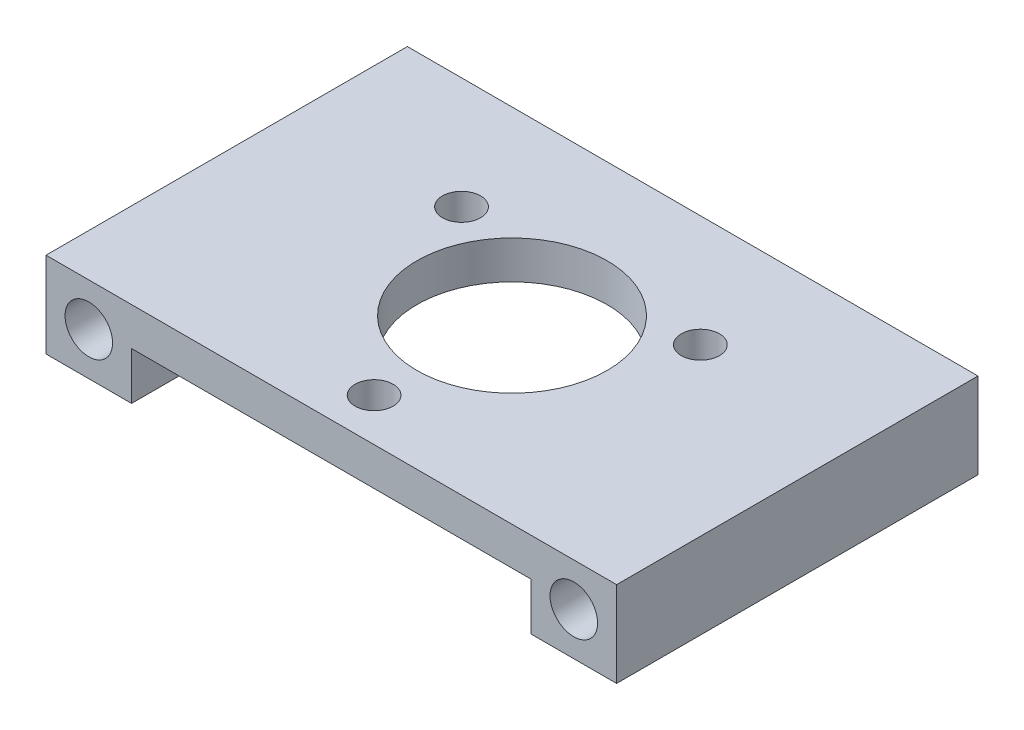
ISO-10303-21;
HEADER;
FILE_DESCRIPTION(('STEP AP214'),'2;1');
FILE_NAME('part.step','',(''),(''),'','','');
FILE_SCHEMA(('AUTOMOTIVE_DESIGN { 1 0 10303 214 1 1 1 1 }'));
ENDSEC;
DATA;
#1=APPLICATION_CONTEXT('core data for automotive mechanical design processes');
#2=APPLICATION_PROTOCOL_DEFINITION('international standard','automotive_design',2000,#1);
#3=PRODUCT_CONTEXT('',#1,'mechanical');
#4=PRODUCT('Part','Part','',(#3));
#5=PRODUCT_RELATED_PRODUCT_CATEGORY('part','',(#4));
#6=PRODUCT_DEFINITION_FORMATION('','',#4);
#7=PRODUCT_DEFINITION_CONTEXT('part definition',#1,'design');
#8=PRODUCT_DEFINITION('design','',#6,#7);
#9=PRODUCT_DEFINITION_SHAPE('','',#8);
#10=(LENGTH_UNIT() NAMED_UNIT(*) SI_UNIT(.MILLI.,.METRE.));
#11=(NAMED_UNIT(*) PLANE_ANGLE_UNIT() SI_UNIT($,.RADIAN.));
#12=(NAMED_UNIT(*) SI_UNIT($,.STERADIAN.) SOLID_ANGLE_UNIT());
#13=UNCERTAINTY_MEASURE_WITH_UNIT(LENGTH_MEASURE(1.E-05),#10,'distance_accuracy_value','');
#14=(GEOMETRIC_REPRESENTATION_CONTEXT(3) GLOBAL_UNCERTAINTY_ASSIGNED_CONTEXT((#13)) GLOBAL_UNIT_ASSIGNED_CONTEXT((#10,
#11,#12)) REPRESENTATION_CONTEXT('',''));
#15=CARTESIAN_POINT('',(0.,0.,0.));
#16=DIRECTION('',(0.,0.,1.));
#17=DIRECTION('',(1.,0.,0.));
#18=AXIS2_PLACEMENT_3D('',#15,#16,#17);
#19=CARTESIAN_POINT('',(0.,0.,38.));
#20=DIRECTION('',(0.,0.,-1.));
#21=DIRECTION('',(-1.,0.,0.));
#22=AXIS2_PLACEMENT_3D('',#19,#20,#21);
#23=PLANE('',#22);
#24=DIRECTION('',(-1.,0.,0.));
#25=VECTOR('',#24,1.);
#26=CARTESIAN_POINT('',(-30.,0.,38.));
#27=LINE('',#26,#25);
#28=CARTESIAN_POINT('',(30.,0.,38.));
#29=VERTEX_POINT('',#28);
#30=CARTESIAN_POINT('',(-30.,0.,38.));
#31=VERTEX_POINT('',#30);
#32=EDGE_CURVE('E146',#29,#31,#27,.T.);
#33=ORIENTED_EDGE('',*,*,#32,.T.);
#34=DIRECTION('',(0.,-1.,0.));
#35=VECTOR('',#34,1.);
#36=CARTESIAN_POINT('',(-30.,0.,38.));
#37=LINE('',#36,#35);
#38=CARTESIAN_POINT('',(-30.,-9.00000000000001,38.));
#39=VERTEX_POINT('',#38);
#40=EDGE_CURVE('E94',#31,#39,#37,.T.);
#41=ORIENTED_EDGE('',*,*,#40,.T.);
#42=DIRECTION('',(1.,0.,0.));
#43=VECTOR('',#42,1.);
#44=CARTESIAN_POINT('',(-30.,-9.00000000000001,38.));
#45=LINE('',#44,#43);
#46=CARTESIAN_POINT('',(-21.,-9.00000000000001,38.));
#47=VERTEX_POINT('',#46);
#48=EDGE_CURVE('E161',#39,#47,#45,.T.);
#49=ORIENTED_EDGE('',*,*,#48,.T.);
#50=DIRECTION('',(0.,1.,0.));
#51=VECTOR('',#50,1.);
#52=CARTESIAN_POINT('',(-21.,-9.00000000000001,38.));
#53=LINE('',#52,#51);
#54=CARTESIAN_POINT('',(-21.,-4.,38.));
#55=VERTEX_POINT('',#54);
#56=EDGE_CURVE('E174',#47,#55,#53,.T.);
#57=ORIENTED_EDGE('',*,*,#56,.T.);
#58=DIRECTION('',(1.,0.,0.));
#59=VECTOR('',#58,1.);
#60=CARTESIAN_POINT('',(-21.,-4.,38.));
#61=LINE('',#60,#59);
#62=CARTESIAN_POINT('',(21.,-4.,38.));
#63=VERTEX_POINT('',#62);
#64=EDGE_CURVE('E113',#55,#63,#61,.T.);
#65=ORIENTED_EDGE('',*,*,#64,.T.);
#66=DIRECTION('',(0.,-1.,0.));
#67=VECTOR('',#66,1.);
#68=CARTESIAN_POINT('',(21.,-9.,38.));
#69=LINE('',#68,#67);
#70=CARTESIAN_POINT('',(21.,-9.,38.));
#71=VERTEX_POINT('',#70);
#72=EDGE_CURVE('E107',#63,#71,#69,.T.);
#73=ORIENTED_EDGE('',*,*,#72,.T.);
#74=DIRECTION('',(1.,0.,0.));
#75=VECTOR('',#74,1.);
#76=CARTESIAN_POINT('',(30.,-9.,38.));
#77=LINE('',#76,#75);
#78=CARTESIAN_POINT('',(30.,-9.,38.));
#79=VERTEX_POINT('',#78);
#80=EDGE_CURVE('E111',#71,#79,#77,.T.);
#81=ORIENTED_EDGE('',*,*,#80,.T.);
#82=DIRECTION('',(0.,1.,0.));
#83=VECTOR('',#82,1.);
#84=CARTESIAN_POINT('',(30.,0.,38.));
#85=LINE('',#84,#83);
#86=EDGE_CURVE('E51',#79,#29,#85,.T.);
#87=ORIENTED_EDGE('',*,*,#86,.T.);
#88=EDGE_LOOP('',(#33,#41,#49,#57,#65,#73,#81,#87));
#89=FACE_BOUND('',#88,.T.);
#90=CARTESIAN_POINT('',(25.5,-4.5,38.));
#91=DIRECTION('',(0.,0.,1.));
#92=DIRECTION('',(-1.,0.,0.));
#93=AXIS2_PLACEMENT_3D('',#90,#91,#92);
#94=CIRCLE('',#93,2.5);
#95=CARTESIAN_POINT('',(23.,-4.5,38.));
#96=VERTEX_POINT('',#95);
#97=EDGE_CURVE('E135',#96,#96,#94,.T.);
#98=ORIENTED_EDGE('',*,*,#97,.F.);
#99=EDGE_LOOP('',(#98));
#100=FACE_BOUND('',#99,.T.);
#101=CARTESIAN_POINT('',(-25.5,-4.5,38.));
#102=DIRECTION('',(0.,0.,1.));
#103=DIRECTION('',(1.,0.,0.));
#104=AXIS2_PLACEMENT_3D('',#101,#102,#103);
#105=CIRCLE('',#104,2.5);
#106=CARTESIAN_POINT('',(-23.,-4.5,38.));
#107=VERTEX_POINT('',#106);
#108=EDGE_CURVE('E183',#107,#107,#105,.T.);
#109=ORIENTED_EDGE('',*,*,#108,.F.);
#110=EDGE_LOOP('',(#109));
#111=FACE_BOUND('',#110,.T.);
#112=ADVANCED_FACE('F34',(#89,#100,#111),#23,.F.);
#113=CARTESIAN_POINT('',(0.,0.,0.));
#114=DIRECTION('',(0.,0.,-1.));
#115=DIRECTION('',(-1.,0.,0.));
#116=AXIS2_PLACEMENT_3D('',#113,#114,#115);
#117=PLANE('',#116);
#118=CARTESIAN_POINT('',(25.5,-4.5,0.));
#119=DIRECTION('',(0.,0.,1.));
#120=DIRECTION('',(-1.,0.,0.));
#121=AXIS2_PLACEMENT_3D('',#118,#119,#120);
#122=CIRCLE('',#121,2.5);
#123=CARTESIAN_POINT('',(23.,-4.5,0.));
#124=VERTEX_POINT('',#123);
#125=EDGE_CURVE('E180',#124,#124,#122,.T.);
#126=ORIENTED_EDGE('',*,*,#125,.T.);
#127=EDGE_LOOP('',(#126));
#128=FACE_BOUND('',#127,.T.);
#129=DIRECTION('',(-1.,0.,0.));
#130=VECTOR('',#129,1.);
#131=CARTESIAN_POINT('',(-30.,0.,0.));
#132=LINE('',#131,#130);
#133=CARTESIAN_POINT('',(30.,0.,0.));
#134=VERTEX_POINT('',#133);
#135=CARTESIAN_POINT('',(-30.,0.,0.));
#136=VERTEX_POINT('',#135);
#137=EDGE_CURVE('E131',#134,#136,#132,.T.);
#138=ORIENTED_EDGE('',*,*,#137,.F.);
#139=DIRECTION('',(0.,1.,0.));
#140=VECTOR('',#139,1.);
#141=CARTESIAN_POINT('',(30.,0.,0.));
#142=LINE('',#141,#140);
#143=CARTESIAN_POINT('',(30.,-9.,0.));
#144=VERTEX_POINT('',#143);
#145=EDGE_CURVE('E86',#144,#134,#142,.T.);
#146=ORIENTED_EDGE('',*,*,#145,.F.);
#147=DIRECTION('',(1.,0.,0.));
#148=VECTOR('',#147,1.);
#149=CARTESIAN_POINT('',(30.,-9.,0.));
#150=LINE('',#149,#148);
#151=CARTESIAN_POINT('',(21.,-9.,0.));
#152=VERTEX_POINT('',#151);
#153=EDGE_CURVE('E80',#152,#144,#150,.T.);
#154=ORIENTED_EDGE('',*,*,#153,.F.);
#155=DIRECTION('',(0.,-1.,0.));
#156=VECTOR('',#155,1.);
#157=CARTESIAN_POINT('',(21.,-9.,0.));
#158=LINE('',#157,#156);
#159=CARTESIAN_POINT('',(21.,-4.,0.));
#160=VERTEX_POINT('',#159);
#161=EDGE_CURVE('E121',#160,#152,#158,.T.);
#162=ORIENTED_EDGE('',*,*,#161,.F.);
#163=DIRECTION('',(1.,0.,0.));
#164=VECTOR('',#163,1.);
#165=CARTESIAN_POINT('',(-21.,-4.,0.));
#166=LINE('',#165,#164);
#167=CARTESIAN_POINT('',(-21.,-4.,0.));
#168=VERTEX_POINT('',#167);
#169=EDGE_CURVE('E141',#168,#160,#166,.T.);
#170=ORIENTED_EDGE('',*,*,#169,.F.);
#171=DIRECTION('',(0.,1.,0.));
#172=VECTOR('',#171,1.);
#173=CARTESIAN_POINT('',(-21.,-9.00000000000001,0.));
#174=LINE('',#173,#172);
#175=CARTESIAN_POINT('',(-21.,-9.00000000000001,0.));
#176=VERTEX_POINT('',#175);
#177=EDGE_CURVE('E139',#176,#168,#174,.T.);
#178=ORIENTED_EDGE('',*,*,#177,.F.);
#179=DIRECTION('',(1.,0.,0.));
#180=VECTOR('',#179,1.);
#181=CARTESIAN_POINT('',(-30.,-9.00000000000001,0.));
#182=LINE('',#181,#180);
#183=CARTESIAN_POINT('',(-30.,-9.00000000000001,0.));
#184=VERTEX_POINT('',#183);
#185=EDGE_CURVE('E137',#184,#176,#182,.T.);
#186=ORIENTED_EDGE('',*,*,#185,.F.);
#187=DIRECTION('',(0.,-1.,0.));
#188=VECTOR('',#187,1.);
#189=CARTESIAN_POINT('',(-30.,0.,0.));
#190=LINE('',#189,#188);
#191=EDGE_CURVE('E134',#136,#184,#190,.T.);
#192=ORIENTED_EDGE('',*,*,#191,.F.);
#193=EDGE_LOOP('',(#138,#146,#154,#162,#170,#178,#186,#192));
#194=FACE_BOUND('',#193,.T.);
#195=CARTESIAN_POINT('',(-25.5,-4.5,0.));
#196=DIRECTION('',(0.,0.,1.));
#197=DIRECTION('',(1.,0.,0.));
#198=AXIS2_PLACEMENT_3D('',#195,#196,#197);
#199=CIRCLE('',#198,2.5);
#200=CARTESIAN_POINT('',(-23.,-4.5,0.));
#201=VERTEX_POINT('',#200);
#202=EDGE_CURVE('E186',#201,#201,#199,.T.);
#203=ORIENTED_EDGE('',*,*,#202,.T.);
#204=EDGE_LOOP('',(#203));
#205=FACE_BOUND('',#204,.T.);
#206=ADVANCED_FACE('F165',(#128,#194,#205),#117,.T.);
#207=CARTESIAN_POINT('',(-30.,0.,38.));
#208=DIRECTION('',(0.,-1.,0.));
#209=DIRECTION('',(1.,0.,0.));
#210=AXIS2_PLACEMENT_3D('',#207,#208,#209);
#211=PLANE('',#210);
#212=CARTESIAN_POINT('',(-12.5573683548735,0.,11.7499999999996));
#213=DIRECTION('',(0.,-1.,0.));
#214=DIRECTION('',(1.,0.,0.));
#215=AXIS2_PLACEMENT_3D('',#212,#213,#214);
#216=CIRCLE('',#215,2.);
#217=CARTESIAN_POINT('',(-10.5573683548735,0.,11.7499999999996));
#218=VERTEX_POINT('',#217);
#219=EDGE_CURVE('E189',#218,#218,#216,.T.);
#220=ORIENTED_EDGE('',*,*,#219,.T.);
#221=EDGE_LOOP('',(#220));
#222=FACE_BOUND('',#221,.T.);
#223=CARTESIAN_POINT('',(12.5573683548752,0.,11.7500000000005));
#224=DIRECTION('',(0.,-1.,0.));
#225=DIRECTION('',(1.,0.,0.));
#226=AXIS2_PLACEMENT_3D('',#223,#224,#225);
#227=CIRCLE('',#226,2.);
#228=CARTESIAN_POINT('',(14.5573683548752,0.,11.7500000000005));
#229=VERTEX_POINT('',#228);
#230=EDGE_CURVE('E194',#229,#229,#227,.T.);
#231=ORIENTED_EDGE('',*,*,#230,.T.);
#232=EDGE_LOOP('',(#231));
#233=FACE_BOUND('',#232,.T.);
#234=CARTESIAN_POINT('',(0.,0.,33.5));
#235=DIRECTION('',(0.,-1.,0.));
#236=DIRECTION('',(1.,0.,0.));
#237=AXIS2_PLACEMENT_3D('',#234,#235,#236);
#238=CIRCLE('',#237,2.);
#239=CARTESIAN_POINT('',(2.,0.,33.5));
#240=VERTEX_POINT('',#239);
#241=EDGE_CURVE('E197',#240,#240,#238,.T.);
#242=ORIENTED_EDGE('',*,*,#241,.T.);
#243=EDGE_LOOP('',(#242));
#244=FACE_BOUND('',#243,.T.);
#245=CARTESIAN_POINT('',(0.,0.,19.));
#246=DIRECTION('',(0.,-1.,0.));
#247=DIRECTION('',(1.,0.,0.));
#248=AXIS2_PLACEMENT_3D('',#245,#246,#247);
#249=CIRCLE('',#248,10.);
#250=CARTESIAN_POINT('',(10.,0.,19.));
#251=VERTEX_POINT('',#250);
#252=EDGE_CURVE('E200',#251,#251,#249,.T.);
#253=ORIENTED_EDGE('',*,*,#252,.T.);
#254=EDGE_LOOP('',(#253));
#255=FACE_BOUND('',#254,.T.);
#256=ORIENTED_EDGE('',*,*,#137,.T.);
#257=DIRECTION('',(0.,0.,-1.));
#258=VECTOR('',#257,1.);
#259=CARTESIAN_POINT('',(-30.,0.,38.));
#260=LINE('',#259,#258);
#261=EDGE_CURVE('E11',#31,#136,#260,.T.);
#262=ORIENTED_EDGE('',*,*,#261,.F.);
#263=ORIENTED_EDGE('',*,*,#32,.F.);
#264=DIRECTION('',(0.,0.,-1.));
#265=VECTOR('',#264,1.);
#266=CARTESIAN_POINT('',(30.,0.,38.));
#267=LINE('',#266,#265);
#268=EDGE_CURVE('E127',#29,#134,#267,.T.);
#269=ORIENTED_EDGE('',*,*,#268,.T.);
#270=EDGE_LOOP('',(#256,#262,#263,#269));
#271=FACE_BOUND('',#270,.T.);
#272=ADVANCED_FACE('F36',(#222,#233,#244,#255,#271),#211,.F.);
#273=CARTESIAN_POINT('',(-30.,0.,38.));
#274=DIRECTION('',(1.,0.,0.));
#275=DIRECTION('',(0.,0.,-1.));
#276=AXIS2_PLACEMENT_3D('',#273,#274,#275);
#277=PLANE('',#276);
#278=ORIENTED_EDGE('',*,*,#191,.T.);
#279=DIRECTION('',(0.,0.,-1.));
#280=VECTOR('',#279,1.);
#281=CARTESIAN_POINT('',(-30.,-9.00000000000001,38.));
#282=LINE('',#281,#280);
#283=EDGE_CURVE('E43',#39,#184,#282,.T.);
#284=ORIENTED_EDGE('',*,*,#283,.F.);
#285=ORIENTED_EDGE('',*,*,#40,.F.);
#286=ORIENTED_EDGE('',*,*,#261,.T.);
#287=EDGE_LOOP('',(#278,#284,#285,#286));
#288=FACE_BOUND('',#287,.T.);
#289=ADVANCED_FACE('F234',(#288),#277,.F.);
#290=CARTESIAN_POINT('',(-30.,-9.00000000000001,38.));
#291=DIRECTION('',(0.,1.,0.));
#292=DIRECTION('',(0.,0.,1.));
#293=AXIS2_PLACEMENT_3D('',#290,#291,#292);
#294=PLANE('',#293);
#295=ORIENTED_EDGE('',*,*,#185,.T.);
#296=DIRECTION('',(0.,0.,-1.));
#297=VECTOR('',#296,1.);
#298=CARTESIAN_POINT('',(-21.,-9.00000000000001,38.));
#299=LINE('',#298,#297);
#300=EDGE_CURVE('E153',#47,#176,#299,.T.);
#301=ORIENTED_EDGE('',*,*,#300,.F.);
#302=ORIENTED_EDGE('',*,*,#48,.F.);
#303=ORIENTED_EDGE('',*,*,#283,.T.);
#304=EDGE_LOOP('',(#295,#301,#302,#303));
#305=FACE_BOUND('',#304,.T.);
#306=ADVANCED_FACE('F159',(#305),#294,.F.);
#307=CARTESIAN_POINT('',(-21.,-9.00000000000001,38.));
#308=DIRECTION('',(-1.,0.,0.));
#309=DIRECTION('',(0.,0.,1.));
#310=AXIS2_PLACEMENT_3D('',#307,#308,#309);
#311=PLANE('',#310);
#312=ORIENTED_EDGE('',*,*,#177,.T.);
#313=DIRECTION('',(0.,0.,-1.));
#314=VECTOR('',#313,1.);
#315=CARTESIAN_POINT('',(-21.,-4.,38.));
#316=LINE('',#315,#314);
#317=EDGE_CURVE('E150',#55,#168,#316,.T.);
#318=ORIENTED_EDGE('',*,*,#317,.F.);
#319=ORIENTED_EDGE('',*,*,#56,.F.);
#320=ORIENTED_EDGE('',*,*,#300,.T.);
#321=EDGE_LOOP('',(#312,#318,#319,#320));
#322=FACE_BOUND('',#321,.T.);
#323=ADVANCED_FACE('F170',(#322),#311,.F.);
#324=CARTESIAN_POINT('',(-21.,-4.,38.));
#325=DIRECTION('',(0.,1.,0.));
#326=DIRECTION('',(0.,0.,1.));
#327=AXIS2_PLACEMENT_3D('',#324,#325,#326);
#328=PLANE('',#327);
#329=CARTESIAN_POINT('',(-12.5573683548735,-4.,11.7499999999996));
#330=DIRECTION('',(0.,-1.,0.));
#331=DIRECTION('',(1.,0.,0.));
#332=AXIS2_PLACEMENT_3D('',#329,#330,#331);
#333=CIRCLE('',#332,2.);
#334=CARTESIAN_POINT('',(-10.5573683548735,-4.,11.7499999999996));
#335=VERTEX_POINT('',#334);
#336=EDGE_CURVE('E207',#335,#335,#333,.T.);
#337=ORIENTED_EDGE('',*,*,#336,.F.);
#338=EDGE_LOOP('',(#337));
#339=FACE_BOUND('',#338,.T.);
#340=CARTESIAN_POINT('',(12.5573683548752,-4.,11.7500000000005));
#341=DIRECTION('',(0.,-1.,0.));
#342=DIRECTION('',(1.,0.,0.));
#343=AXIS2_PLACEMENT_3D('',#340,#341,#342);
#344=CIRCLE('',#343,2.);
#345=CARTESIAN_POINT('',(14.5573683548752,-4.,11.7500000000005));
#346=VERTEX_POINT('',#345);
#347=EDGE_CURVE('E210',#346,#346,#344,.T.);
#348=ORIENTED_EDGE('',*,*,#347,.F.);
#349=EDGE_LOOP('',(#348));
#350=FACE_BOUND('',#349,.T.);
#351=CARTESIAN_POINT('',(0.,-4.,33.5));
#352=DIRECTION('',(0.,-1.,0.));
#353=DIRECTION('',(1.,0.,0.));
#354=AXIS2_PLACEMENT_3D('',#351,#352,#353);
#355=CIRCLE('',#354,2.);
#356=CARTESIAN_POINT('',(2.,-4.,33.5));
#357=VERTEX_POINT('',#356);
#358=EDGE_CURVE('E206',#357,#357,#355,.T.);
#359=ORIENTED_EDGE('',*,*,#358,.F.);
#360=EDGE_LOOP('',(#359));
#361=FACE_BOUND('',#360,.T.);
#362=CARTESIAN_POINT('',(0.,-4.,19.));
#363=DIRECTION('',(0.,-1.,0.));
#364=DIRECTION('',(1.,0.,0.));
#365=AXIS2_PLACEMENT_3D('',#362,#363,#364);
#366=CIRCLE('',#365,10.);
#367=CARTESIAN_POINT('',(10.,-4.,19.));
#368=VERTEX_POINT('',#367);
#369=EDGE_CURVE('E203',#368,#368,#366,.T.);
#370=ORIENTED_EDGE('',*,*,#369,.F.);
#371=EDGE_LOOP('',(#370));
#372=FACE_BOUND('',#371,.T.);
#373=ORIENTED_EDGE('',*,*,#169,.T.);
#374=DIRECTION('',(0.,0.,-1.));
#375=VECTOR('',#374,1.);
#376=CARTESIAN_POINT('',(21.,-4.,38.));
#377=LINE('',#376,#375);
#378=EDGE_CURVE('E122',#63,#160,#377,.T.);
#379=ORIENTED_EDGE('',*,*,#378,.F.);
#380=ORIENTED_EDGE('',*,*,#64,.F.);
#381=ORIENTED_EDGE('',*,*,#317,.T.);
#382=EDGE_LOOP('',(#373,#379,#380,#381));
#383=FACE_BOUND('',#382,.T.);
#384=ADVANCED_FACE('F173',(#339,#350,#361,#372,#383),#328,.F.);
#385=CARTESIAN_POINT('',(21.,-9.,38.));
#386=DIRECTION('',(1.,0.,0.));
#387=DIRECTION('',(0.,1.,0.));
#388=AXIS2_PLACEMENT_3D('',#385,#386,#387);
#389=PLANE('',#388);
#390=ORIENTED_EDGE('',*,*,#161,.T.);
#391=DIRECTION('',(0.,0.,-1.));
#392=VECTOR('',#391,1.);
#393=CARTESIAN_POINT('',(21.,-9.,38.));
#394=LINE('',#393,#392);
#395=EDGE_CURVE('E118',#71,#152,#394,.T.);
#396=ORIENTED_EDGE('',*,*,#395,.F.);
#397=ORIENTED_EDGE('',*,*,#72,.F.);
#398=ORIENTED_EDGE('',*,*,#378,.T.);
#399=EDGE_LOOP('',(#390,#396,#397,#398));
#400=FACE_BOUND('',#399,.T.);
#401=ADVANCED_FACE('F119',(#400),#389,.F.);
#402=CARTESIAN_POINT('',(30.,-9.,38.));
#403=DIRECTION('',(0.,1.,0.));
#404=DIRECTION('',(0.,0.,1.));
#405=AXIS2_PLACEMENT_3D('',#402,#403,#404);
#406=PLANE('',#405);
#407=ORIENTED_EDGE('',*,*,#153,.T.);
#408=DIRECTION('',(0.,0.,-1.));
#409=VECTOR('',#408,1.);
#410=CARTESIAN_POINT('',(30.,-9.,38.));
#411=LINE('',#410,#409);
#412=EDGE_CURVE('E123',#79,#144,#411,.T.);
#413=ORIENTED_EDGE('',*,*,#412,.F.);
#414=ORIENTED_EDGE('',*,*,#80,.F.);
#415=ORIENTED_EDGE('',*,*,#395,.T.);
#416=EDGE_LOOP('',(#407,#413,#414,#415));
#417=FACE_BOUND('',#416,.T.);
#418=ADVANCED_FACE('F125',(#417),#406,.F.);
#419=CARTESIAN_POINT('',(30.,0.,38.));
#420=DIRECTION('',(-1.,0.,0.));
#421=DIRECTION('',(0.,0.,1.));
#422=AXIS2_PLACEMENT_3D('',#419,#420,#421);
#423=PLANE('',#422);
#424=ORIENTED_EDGE('',*,*,#145,.T.);
#425=ORIENTED_EDGE('',*,*,#268,.F.);
#426=ORIENTED_EDGE('',*,*,#86,.F.);
#427=ORIENTED_EDGE('',*,*,#412,.T.);
#428=EDGE_LOOP('',(#424,#425,#426,#427));
#429=FACE_BOUND('',#428,.T.);
#430=ADVANCED_FACE('F238',(#429),#423,.F.);
#431=CARTESIAN_POINT('',(25.5,-4.5,38.));
#432=DIRECTION('',(0.,0.,-1.));
#433=DIRECTION('',(-1.,0.,0.));
#434=AXIS2_PLACEMENT_3D('',#431,#432,#433);
#435=CYLINDRICAL_SURFACE('',#434,2.5);
#436=ORIENTED_EDGE('',*,*,#97,.T.);
#437=EDGE_LOOP('',(#436));
#438=FACE_BOUND('',#437,.T.);
#439=ORIENTED_EDGE('',*,*,#125,.F.);
#440=EDGE_LOOP('',(#439));
#441=FACE_BOUND('',#440,.T.);
#442=ADVANCED_FACE('F240',(#438,#441),#435,.F.);
#443=CARTESIAN_POINT('',(-25.5,-4.5,38.));
#444=DIRECTION('',(0.,0.,-1.));
#445=DIRECTION('',(-1.,0.,0.));
#446=AXIS2_PLACEMENT_3D('',#443,#444,#445);
#447=CYLINDRICAL_SURFACE('',#446,2.5);
#448=ORIENTED_EDGE('',*,*,#108,.T.);
#449=EDGE_LOOP('',(#448));
#450=FACE_BOUND('',#449,.T.);
#451=ORIENTED_EDGE('',*,*,#202,.F.);
#452=EDGE_LOOP('',(#451));
#453=FACE_BOUND('',#452,.T.);
#454=ADVANCED_FACE('F228',(#450,#453),#447,.F.);
#455=CARTESIAN_POINT('',(0.,34.,19.));
#456=DIRECTION('',(0.,-1.,0.));
#457=DIRECTION('',(1.,0.,0.));
#458=AXIS2_PLACEMENT_3D('',#455,#456,#457);
#459=CYLINDRICAL_SURFACE('',#458,10.);
#460=ORIENTED_EDGE('',*,*,#369,.T.);
#461=EDGE_LOOP('',(#460));
#462=FACE_BOUND('',#461,.T.);
#463=ORIENTED_EDGE('',*,*,#252,.F.);
#464=EDGE_LOOP('',(#463));
#465=FACE_BOUND('',#464,.T.);
#466=ADVANCED_FACE('F225',(#462,#465),#459,.F.);
#467=CARTESIAN_POINT('',(0.,34.,33.5));
#468=DIRECTION('',(0.,-1.,0.));
#469=DIRECTION('',(1.,0.,0.));
#470=AXIS2_PLACEMENT_3D('',#467,#468,#469);
#471=CYLINDRICAL_SURFACE('',#470,2.);
#472=ORIENTED_EDGE('',*,*,#358,.T.);
#473=EDGE_LOOP('',(#472));
#474=FACE_BOUND('',#473,.T.);
#475=ORIENTED_EDGE('',*,*,#241,.F.);
#476=EDGE_LOOP('',(#475));
#477=FACE_BOUND('',#476,.T.);
#478=ADVANCED_FACE('F216',(#474,#477),#471,.F.);
#479=CARTESIAN_POINT('',(12.5573683548753,34.,11.7500000000005));
#480=DIRECTION('',(0.,-1.,0.));
#481=DIRECTION('',(1.,0.,0.));
#482=AXIS2_PLACEMENT_3D('',#479,#480,#481);
#483=CYLINDRICAL_SURFACE('',#482,2.);
#484=ORIENTED_EDGE('',*,*,#347,.T.);
#485=EDGE_LOOP('',(#484));
#486=FACE_BOUND('',#485,.T.);
#487=ORIENTED_EDGE('',*,*,#230,.F.);
#488=EDGE_LOOP('',(#487));
#489=FACE_BOUND('',#488,.T.);
#490=ADVANCED_FACE('F263',(#486,#489),#483,.F.);
#491=CARTESIAN_POINT('',(-12.5573683548735,34.,11.7499999999996));
#492=DIRECTION('',(0.,-1.,0.));
#493=DIRECTION('',(1.,0.,0.));
#494=AXIS2_PLACEMENT_3D('',#491,#492,#493);
#495=CYLINDRICAL_SURFACE('',#494,2.);
#496=ORIENTED_EDGE('',*,*,#336,.T.);
#497=EDGE_LOOP('',(#496));
#498=FACE_BOUND('',#497,.T.);
#499=ORIENTED_EDGE('',*,*,#219,.F.);
#500=EDGE_LOOP('',(#499));
#501=FACE_BOUND('',#500,.T.);
#502=ADVANCED_FACE('F260',(#498,#501),#495,.F.);
#503=CLOSED_SHELL('',(#112,#206,#272,#289,#306,#323,#384,#401,#418,#430,#442,#454,#466,#478,
#490,#502));
#504=MANIFOLD_SOLID_BREP('B2',#503);
#505=ADVANCED_BREP_SHAPE_REPRESENTATION('',(#18,#504),#14);
#506=SHAPE_DEFINITION_REPRESENTATION(#9,#505);
ENDSEC;
END-ISO-10303-21;
